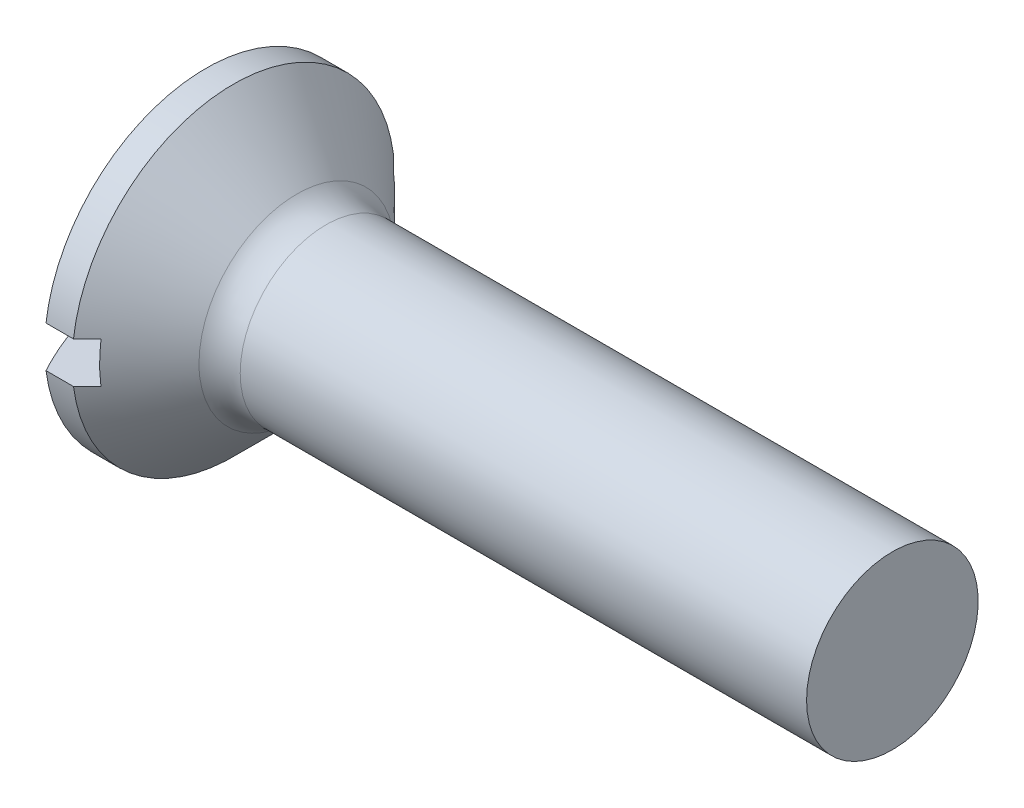
ISO-10303-21;
HEADER;
FILE_DESCRIPTION(('STEP AP214'),'2;1');
FILE_NAME('part.step','',(''),(''),'','','');
FILE_SCHEMA(('AUTOMOTIVE_DESIGN { 1 0 10303 214 1 1 1 1 }'));
ENDSEC;
DATA;
#1=APPLICATION_CONTEXT('core data for automotive mechanical design processes');
#2=APPLICATION_PROTOCOL_DEFINITION('international standard','automotive_design',2000,#1);
#3=PRODUCT_CONTEXT('',#1,'mechanical');
#4=PRODUCT('Part','Part','',(#3));
#5=PRODUCT_RELATED_PRODUCT_CATEGORY('part','',(#4));
#6=PRODUCT_DEFINITION_FORMATION('','',#4);
#7=PRODUCT_DEFINITION_CONTEXT('part definition',#1,'design');
#8=PRODUCT_DEFINITION('design','',#6,#7);
#9=PRODUCT_DEFINITION_SHAPE('','',#8);
#10=(LENGTH_UNIT() NAMED_UNIT(*) SI_UNIT(.MILLI.,.METRE.));
#11=(NAMED_UNIT(*) PLANE_ANGLE_UNIT() SI_UNIT($,.RADIAN.));
#12=(NAMED_UNIT(*) SI_UNIT($,.STERADIAN.) SOLID_ANGLE_UNIT());
#13=UNCERTAINTY_MEASURE_WITH_UNIT(LENGTH_MEASURE(1.E-05),#10,'distance_accuracy_value','');
#14=(GEOMETRIC_REPRESENTATION_CONTEXT(3) GLOBAL_UNCERTAINTY_ASSIGNED_CONTEXT((#13)) GLOBAL_UNIT_ASSIGNED_CONTEXT((#10,
#11,#12)) REPRESENTATION_CONTEXT('',''));
#15=CARTESIAN_POINT('',(0.,0.,0.));
#16=DIRECTION('',(0.,0.,1.));
#17=DIRECTION('',(1.,0.,0.));
#18=AXIS2_PLACEMENT_3D('',#15,#16,#17);
#19=CARTESIAN_POINT('',(4.90208333333334,0.,0.));
#20=DIRECTION('',(-1.,0.,0.));
#21=DIRECTION('',(0.,-1.,0.));
#22=AXIS2_PLACEMENT_3D('',#19,#20,#21);
#23=SPHERICAL_SURFACE('',#22,4.90208333333334);
#24=CARTESIAN_POINT('',(4.90208333333334,0.3,0.));
#25=DIRECTION('',(0.,1.,0.));
#26=DIRECTION('',(0.,0.,1.));
#27=AXIS2_PLACEMENT_3D('',#24,#25,#26);
#28=CIRCLE('',#27,4.89289495155419);
#29=CARTESIAN_POINT('',(0.6,0.3,2.33077240416133));
#30=VERTEX_POINT('',#29);
#31=CARTESIAN_POINT('',(0.6,0.3,-2.33077240416133));
#32=VERTEX_POINT('',#31);
#33=EDGE_CURVE('E185',#30,#32,#28,.F.);
#34=ORIENTED_EDGE('',*,*,#33,.F.);
#35=CARTESIAN_POINT('',(0.6,0.,0.));
#36=DIRECTION('',(-1.,0.,0.));
#37=DIRECTION('',(0.,0.,1.));
#38=AXIS2_PLACEMENT_3D('',#35,#36,#37);
#39=CIRCLE('',#38,2.35);
#40=EDGE_CURVE('E119',#30,#32,#39,.T.);
#41=ORIENTED_EDGE('',*,*,#40,.T.);
#42=EDGE_LOOP('',(#34,#41));
#43=FACE_BOUND('',#42,.T.);
#44=ADVANCED_FACE('F39',(#43),#23,.T.);
#45=CARTESIAN_POINT('',(-15.875,0.,0.));
#46=DIRECTION('',(-1.,0.,0.));
#47=DIRECTION('',(0.,0.,1.));
#48=AXIS2_PLACEMENT_3D('',#45,#46,#47);
#49=CYLINDRICAL_SURFACE('',#48,2.35);
#50=CARTESIAN_POINT('',(1.,0.,0.));
#51=DIRECTION('',(-1.,0.,0.));
#52=DIRECTION('',(0.,0.,1.));
#53=AXIS2_PLACEMENT_3D('',#50,#51,#52);
#54=CIRCLE('',#53,2.35);
#55=CARTESIAN_POINT('',(1.,0.3,2.33077240416133));
#56=VERTEX_POINT('',#55);
#57=CARTESIAN_POINT('',(1.,0.3,-2.33077240416133));
#58=VERTEX_POINT('',#57);
#59=EDGE_CURVE('E113',#56,#58,#54,.T.);
#60=ORIENTED_EDGE('',*,*,#59,.T.);
#61=DIRECTION('',(-1.,0.,0.));
#62=VECTOR('',#61,1.);
#63=CARTESIAN_POINT('',(-15.875,0.3,-2.33077240416133));
#64=LINE('',#63,#62);
#65=EDGE_CURVE('E67',#58,#32,#64,.T.);
#66=ORIENTED_EDGE('',*,*,#65,.T.);
#67=ORIENTED_EDGE('',*,*,#40,.F.);
#68=DIRECTION('',(-1.,0.,0.));
#69=VECTOR('',#68,1.);
#70=CARTESIAN_POINT('',(-15.875,0.3,2.33077240416133));
#71=LINE('',#70,#69);
#72=EDGE_CURVE('E183',#30,#56,#71,.F.);
#73=ORIENTED_EDGE('',*,*,#72,.T.);
#74=EDGE_LOOP('',(#60,#66,#67,#73));
#75=FACE_BOUND('',#74,.T.);
#76=ADVANCED_FACE('F157',(#75),#49,.T.);
#77=CARTESIAN_POINT('',(10.6,0.,0.));
#78=DIRECTION('',(-1.,0.,0.));
#79=DIRECTION('',(0.,0.,1.));
#80=AXIS2_PLACEMENT_3D('',#77,#78,#79);
#81=PLANE('',#80);
#82=CARTESIAN_POINT('',(10.6,0.,0.));
#83=DIRECTION('',(-1.,0.,0.));
#84=DIRECTION('',(0.,0.,1.));
#85=AXIS2_PLACEMENT_3D('',#82,#83,#84);
#86=CIRCLE('',#85,1.25);
#87=CARTESIAN_POINT('',(10.6,0.,1.25));
#88=VERTEX_POINT('',#87);
#89=EDGE_CURVE('E122',#88,#88,#86,.T.);
#90=ORIENTED_EDGE('',*,*,#89,.F.);
#91=EDGE_LOOP('',(#90));
#92=FACE_BOUND('',#91,.T.);
#93=ADVANCED_FACE('F164',(#92),#81,.F.);
#94=CARTESIAN_POINT('',(4.90208333333334,-0.3,0.));
#95=DIRECTION('',(0.,-1.,0.));
#96=DIRECTION('',(0.,0.,-1.));
#97=AXIS2_PLACEMENT_3D('',#94,#95,#96);
#98=CIRCLE('',#97,4.89289495155419);
#99=CARTESIAN_POINT('',(0.6,-0.299999999999999,-2.33077240416133));
#100=VERTEX_POINT('',#99);
#101=CARTESIAN_POINT('',(0.6,-0.3,2.33077240416133));
#102=VERTEX_POINT('',#101);
#103=EDGE_CURVE('E175',#100,#102,#98,.F.);
#104=ORIENTED_EDGE('',*,*,#103,.F.);
#105=EDGE_CURVE('E115',#100,#102,#39,.T.);
#106=ORIENTED_EDGE('',*,*,#105,.T.);
#107=EDGE_LOOP('',(#104,#106));
#108=FACE_BOUND('',#107,.T.);
#109=ADVANCED_FACE('F160',(#108),#23,.T.);
#110=CARTESIAN_POINT('',(1.,-0.299999999999999,-2.33077240416133));
#111=VERTEX_POINT('',#110);
#112=CARTESIAN_POINT('',(1.,-0.3,2.33077240416133));
#113=VERTEX_POINT('',#112);
#114=EDGE_CURVE('E116',#111,#113,#54,.T.);
#115=ORIENTED_EDGE('',*,*,#114,.T.);
#116=DIRECTION('',(-1.,0.,0.));
#117=VECTOR('',#116,1.);
#118=CARTESIAN_POINT('',(-15.875,-0.3,2.33077240416133));
#119=LINE('',#118,#117);
#120=EDGE_CURVE('E178',#113,#102,#119,.T.);
#121=ORIENTED_EDGE('',*,*,#120,.T.);
#122=ORIENTED_EDGE('',*,*,#105,.F.);
#123=DIRECTION('',(-1.,0.,0.));
#124=VECTOR('',#123,1.);
#125=CARTESIAN_POINT('',(-15.875,-0.299999999999999,-2.33077240416133));
#126=LINE('',#125,#124);
#127=EDGE_CURVE('E179',#100,#111,#126,.F.);
#128=ORIENTED_EDGE('',*,*,#127,.T.);
#129=EDGE_LOOP('',(#115,#121,#122,#128));
#130=FACE_BOUND('',#129,.T.);
#131=ADVANCED_FACE('F154',(#130),#49,.T.);
#132=CARTESIAN_POINT('',(1.,0.,0.));
#133=DIRECTION('',(-1.,0.,0.));
#134=DIRECTION('',(0.,0.,1.));
#135=AXIS2_PLACEMENT_3D('',#132,#133,#134);
#136=CONICAL_SURFACE('',#135,2.35,0.785398163397449);
#137=CARTESIAN_POINT('',(-1.82275203672138,0.3,-5.16404527801656));
#138=CARTESIAN_POINT('',(-1.64754958730794,0.3,-4.98854511223448));
#139=CARTESIAN_POINT('',(-1.47236000416515,0.3,-4.81303209254199));
#140=CARTESIAN_POINT('',(-1.12202075460717,0.3,-4.46196190687904));
#141=CARTESIAN_POINT('',(-0.94687108871008,0.3,-4.28640474039159));
#142=CARTESIAN_POINT('',(-0.596582016902504,0.3,-3.93518385937772));
#143=CARTESIAN_POINT('',(-0.421442627058235,0.3,-3.75952012882719));
#144=CARTESIAN_POINT('',(-0.0712537914550258,0.3,-3.40810721702208));
#145=CARTESIAN_POINT('',(0.103795655359153,0.3,-3.23235803681939));
#146=CARTESIAN_POINT('',(0.460088144205839,0.3,-2.87435321817226));
#147=CARTESIAN_POINT('',(0.64132596841188,0.3,-2.6920923874888));
#148=CARTESIAN_POINT('',(1.00354514464606,0.3,-2.32730280190244));
#149=CARTESIAN_POINT('',(1.18452648731344,0.3,-2.14477403769181));
#150=CARTESIAN_POINT('',(1.45556256140296,0.3,-1.87058192238541));
#151=CARTESIAN_POINT('',(1.54582728663923,0.3,-1.77912617438865));
#152=CARTESIAN_POINT('',(1.72613580420795,0.3,-1.59599412728003));
#153=CARTESIAN_POINT('',(1.8161795933095,0.3,-1.50431782498121));
#154=CARTESIAN_POINT('',(1.99588406923986,0.3,-1.32060275611908));
#155=CARTESIAN_POINT('',(2.08554478108396,0.3,-1.22856401400164));
#156=CARTESIAN_POINT('',(2.26418532619347,0.3,-1.04382868301959));
#157=CARTESIAN_POINT('',(2.35316518136162,0.3,-0.951132115503261));
#158=CARTESIAN_POINT('',(2.46505917883394,0.3,-0.832576740840201));
#159=CARTESIAN_POINT('',(2.48870474420126,0.3,-0.807409320196103));
#160=CARTESIAN_POINT('',(2.53583984019124,0.3,-0.756927871802545));
#161=CARTESIAN_POINT('',(2.55932936834119,0.3,-0.731613841741602));
#162=CARTESIAN_POINT('',(2.60601885231769,0.3,-0.680886100047077));
#163=CARTESIAN_POINT('',(2.62921954128008,0.3,-0.655473063997356));
#164=CARTESIAN_POINT('',(2.675337766447,0.3,-0.604392130207134));
#165=CARTESIAN_POINT('',(2.69825531271275,0.3,-0.578724241581383));
#166=CARTESIAN_POINT('',(2.7513958843352,0.3,-0.51826731406406));
#167=CARTESIAN_POINT('',(2.78145962199572,0.3,-0.483338135350433));
#168=CARTESIAN_POINT('',(2.8405689932522,0.3,-0.412218933886534));
#169=CARTESIAN_POINT('',(2.86960673903091,0.3,-0.376022191437645));
#170=CARTESIAN_POINT('',(2.9114850873813,0.3,-0.320072853564384));
#171=CARTESIAN_POINT('',(2.92524917786357,0.3,-0.301017234201491));
#172=CARTESIAN_POINT('',(2.95181957465597,0.3,-0.262201945071994));
#173=CARTESIAN_POINT('',(2.96462456529744,0.3,-0.242441361156985));
#174=CARTESIAN_POINT('',(2.98858863040398,0.3,-0.202182687483552));
#175=CARTESIAN_POINT('',(2.99976230181752,0.3,-0.181693479987382));
#176=CARTESIAN_POINT('',(3.01963945302138,0.3,-0.139575845156781));
#177=CARTESIAN_POINT('',(3.02835070556884,0.3,-0.117951263901652));
#178=CARTESIAN_POINT('',(3.04128209755064,0.3,-0.0753539742139996));
#179=CARTESIAN_POINT('',(3.04582445681639,0.3,-0.0544855635375963));
#180=CARTESIAN_POINT('',(3.05046691822308,0.3,-0.0123288497489134));
#181=CARTESIAN_POINT('',(3.05059046656826,0.3,0.00895663738570289));
#182=CARTESIAN_POINT('',(3.0464261956788,0.3,0.0509505716715626));
#183=CARTESIAN_POINT('',(3.04215902203701,0.3,0.0716612534321086));
#184=CARTESIAN_POINT('',(3.03030119680603,0.3,0.112203509888116));
#185=CARTESIAN_POINT('',(3.02268680351524,0.3,0.132027669143875));
#186=CARTESIAN_POINT('',(3.00622685916693,0.3,0.168572292117351));
#187=CARTESIAN_POINT('',(2.99760294736928,0.3,0.185396783307412));
#188=CARTESIAN_POINT('',(2.97917654074856,0.3,0.218395128215779));
#189=CARTESIAN_POINT('',(2.96937306670495,0.3,0.23456842627038));
#190=CARTESIAN_POINT('',(2.93871149333945,0.3,0.28243197683215));
#191=CARTESIAN_POINT('',(2.91666176421179,0.3,0.313348905503022));
#192=CARTESIAN_POINT('',(2.87076835420826,0.3,0.374243746859669));
#193=CARTESIAN_POINT('',(2.8469094719127,0.3,0.404209782728291));
#194=CARTESIAN_POINT('',(2.79830711124635,0.3,0.463297029753784));
#195=CARTESIAN_POINT('',(2.77356580894545,0.3,0.492420036344017));
#196=CARTESIAN_POINT('',(2.6995553977296,0.3,0.577829838417174));
#197=CARTESIAN_POINT('',(2.64948866646878,0.3,0.633419833726512));
#198=CARTESIAN_POINT('',(2.54836373861698,0.3,0.7436957712889));
#199=CARTESIAN_POINT('',(2.49730537025496,0.3,0.79838155382186));
#200=CARTESIAN_POINT('',(2.39456857586971,0.3,0.907291284144832));
#201=CARTESIAN_POINT('',(2.34288948055459,0.3,0.96151460047886));
#202=CARTESIAN_POINT('',(2.23919742314652,0.3,1.06963184533802));
#203=CARTESIAN_POINT('',(2.18718448744236,0.3,1.12352579925624));
#204=CARTESIAN_POINT('',(2.0318816012677,0.3,1.28379950959911));
#205=CARTESIAN_POINT('',(1.92827632250229,0.3,1.38987351167513));
#206=CARTESIAN_POINT('',(1.72070460330653,0.3,1.60156717940246));
#207=CARTESIAN_POINT('',(1.61673835836866,0.3,1.7071870373648));
#208=CARTESIAN_POINT('',(1.37557159980157,0.3,1.95163773521738));
#209=CARTESIAN_POINT('',(1.23828371519814,0.3,2.0903823802166));
#210=CARTESIAN_POINT('',(0.963486137442309,0.3,2.36765244003563));
#211=CARTESIAN_POINT('',(0.825976443595042,0.3,2.50617785416596));
#212=CARTESIAN_POINT('',(0.413192953066906,0.3,2.92161530315849));
#213=CARTESIAN_POINT('',(0.137721644880257,0.3,3.19833106315822));
#214=CARTESIAN_POINT('',(-0.418538177485844,0.3,3.75665266927046));
#215=CARTESIAN_POINT('',(-0.699330857482734,0.3,4.03825436110322));
#216=CARTESIAN_POINT('',(-1.26099255192529,0.3,4.60125960589025));
#217=CARTESIAN_POINT('',(-1.54186153654612,0.3,4.88266318859486));
#218=CARTESIAN_POINT('',(-1.82275203672138,0.3,5.16404527801656));
#219=B_SPLINE_CURVE_WITH_KNOTS('',3,(#137,#138,#139,#140,#141,#142,#143,#144,#145,#146,#147,
#148,#149,#150,#151,#152,#153,#154,#155,#156,#157,#158,#159,#160,#161,#162,#163,#164,#165,#166,
#167,#168,#169,#170,#171,#172,#173,#174,#175,#176,#177,#178,#179,#180,#181,#182,#183,#184,#185,
#186,#187,#188,#189,#190,#191,#192,#193,#194,#195,#196,#197,#198,#199,#200,#201,#202,#203,#204,
#205,#206,#207,#208,#209,#210,#211,#212,#213,#214,#215,#216,#217,#218),.UNSPECIFIED.,.F.,.F.,(4,
2,2,2,2,2,2,2,2,2,2,2,2,2,2,2,2,2,2,2,2,2,2,2,2,2,2,2,2,2,2,2,2,2,2,2,2,2,2,2,4),(0.,
0.743952870352577,1.48791490152672,2.23208151542587,2.97623918951494,3.74733929563187,
4.51846685478593,4.9039623477983,5.28946344501002,5.6749389716538,6.06040204521683,
6.16399983462291,6.26759926185074,6.37082991302826,6.47405688538717,6.61230458709904,
6.75145089376192,6.82195212826494,6.89254836759327,6.9624680798405,7.03216455728612,
7.09585752678058,7.15921249105328,7.22227090958055,7.28578400348509,7.34244077690176,
7.39914491306139,7.51294472887577,7.62783798502718,7.74246522116449,7.96687196692452,
8.19131793729752,8.41603267760232,8.64072986863151,9.08555454863182,9.53016739044921,
10.115728328683,10.7012911048979,11.8726592944065,13.0656791429272,14.2584398773778),.UNSPECIFIED.);
#220=CARTESIAN_POINT('',(1.2,0.3,2.12896688560438));
#221=VERTEX_POINT('',#220);
#222=EDGE_CURVE('E11',#221,#56,#219,.T.);
#223=ORIENTED_EDGE('',*,*,#222,.F.);
#224=CARTESIAN_POINT('',(1.2,0.,0.));
#225=DIRECTION('',(1.,0.,0.));
#226=DIRECTION('',(0.,0.,-1.));
#227=AXIS2_PLACEMENT_3D('',#224,#225,#226);
#228=CIRCLE('',#227,2.15);
#229=CARTESIAN_POINT('',(1.2,-0.3,2.12896688560438));
#230=VERTEX_POINT('',#229);
#231=EDGE_CURVE('E96',#230,#221,#228,.F.);
#232=ORIENTED_EDGE('',*,*,#231,.F.);
#233=CARTESIAN_POINT('',(-1.82275203672138,-0.3,5.16404527801656));
#234=CARTESIAN_POINT('',(-1.64754958730794,-0.3,4.98854511223448));
#235=CARTESIAN_POINT('',(-1.47236000416515,-0.3,4.81303209254199));
#236=CARTESIAN_POINT('',(-1.12202075460718,-0.3,4.46196190687904));
#237=CARTESIAN_POINT('',(-0.94687108871008,-0.3,4.28640474039159));
#238=CARTESIAN_POINT('',(-0.596582016902505,-0.3,3.93518385937772));
#239=CARTESIAN_POINT('',(-0.421442627058235,-0.3,3.75952012882719));
#240=CARTESIAN_POINT('',(-0.0712537914550263,-0.3,3.40810721702208));
#241=CARTESIAN_POINT('',(0.103795655359153,-0.3,3.23235803681939));
#242=CARTESIAN_POINT('',(0.460088144205839,-0.3,2.87435321817226));
#243=CARTESIAN_POINT('',(0.641325968411881,-0.3,2.6920923874888));
#244=CARTESIAN_POINT('',(1.00354514464606,-0.3,2.32730280190244));
#245=CARTESIAN_POINT('',(1.18452648731344,-0.3,2.14477403769181));
#246=CARTESIAN_POINT('',(1.45556256140296,-0.3,1.87058192238541));
#247=CARTESIAN_POINT('',(1.54582728663923,-0.3,1.77912617438865));
#248=CARTESIAN_POINT('',(1.72613580420796,-0.3,1.59599412728003));
#249=CARTESIAN_POINT('',(1.8161795933095,-0.3,1.50431782498121));
#250=CARTESIAN_POINT('',(1.99588406923986,-0.3,1.32060275611908));
#251=CARTESIAN_POINT('',(2.08554478108396,-0.3,1.22856401400164));
#252=CARTESIAN_POINT('',(2.26418532619348,-0.3,1.04382868301958));
#253=CARTESIAN_POINT('',(2.35316518136162,-0.3,0.95113211550326));
#254=CARTESIAN_POINT('',(2.46505917883394,-0.3,0.832576740840201));
#255=CARTESIAN_POINT('',(2.48870474420126,-0.3,0.807409320196102));
#256=CARTESIAN_POINT('',(2.53583984019124,-0.3,0.756927871802545));
#257=CARTESIAN_POINT('',(2.55932936834119,-0.3,0.731613841741602));
#258=CARTESIAN_POINT('',(2.60601885231769,-0.3,0.680886100047076));
#259=CARTESIAN_POINT('',(2.62921954128008,-0.3,0.655473063997356));
#260=CARTESIAN_POINT('',(2.675337766447,-0.3,0.604392130207134));
#261=CARTESIAN_POINT('',(2.69825531271275,-0.3,0.578724241581382));
#262=CARTESIAN_POINT('',(2.7513958843352,-0.3,0.518267314064059));
#263=CARTESIAN_POINT('',(2.78145962199572,-0.3,0.483338135350433));
#264=CARTESIAN_POINT('',(2.8405689932522,-0.3,0.412218933886534));
#265=CARTESIAN_POINT('',(2.86960673903091,-0.3,0.376022191437645));
#266=CARTESIAN_POINT('',(2.9114850873813,-0.3,0.320072853564383));
#267=CARTESIAN_POINT('',(2.92524917786357,-0.3,0.301017234201491));
#268=CARTESIAN_POINT('',(2.95181957465597,-0.3,0.262201945071994));
#269=CARTESIAN_POINT('',(2.96462456529745,-0.3,0.242441361156985));
#270=CARTESIAN_POINT('',(2.98858863040398,-0.3,0.202182687483552));
#271=CARTESIAN_POINT('',(2.99976230181752,-0.3,0.181693479987382));
#272=CARTESIAN_POINT('',(3.01963945302138,-0.3,0.13957584515678));
#273=CARTESIAN_POINT('',(3.02835070556884,-0.3,0.117951263901652));
#274=CARTESIAN_POINT('',(3.04128209755064,-0.3,0.0753539742139996));
#275=CARTESIAN_POINT('',(3.04582445681639,-0.3,0.0544855635375964));
#276=CARTESIAN_POINT('',(3.05046691822308,-0.3,0.0123288497489135));
#277=CARTESIAN_POINT('',(3.05059046656826,-0.3,-0.00895663738570284));
#278=CARTESIAN_POINT('',(3.0464261956788,-0.3,-0.0509505716715626));
#279=CARTESIAN_POINT('',(3.04215902203701,-0.3,-0.0716612534321086));
#280=CARTESIAN_POINT('',(3.03030119680603,-0.3,-0.112203509888116));
#281=CARTESIAN_POINT('',(3.02268680351524,-0.3,-0.132027669143875));
#282=CARTESIAN_POINT('',(3.00622685916693,-0.3,-0.168572292117351));
#283=CARTESIAN_POINT('',(2.99760294736928,-0.3,-0.185396783307412));
#284=CARTESIAN_POINT('',(2.97917654074856,-0.3,-0.218395128215779));
#285=CARTESIAN_POINT('',(2.96937306670495,-0.3,-0.234568426270379));
#286=CARTESIAN_POINT('',(2.93871149333945,-0.3,-0.282431976832149));
#287=CARTESIAN_POINT('',(2.91666176421179,-0.3,-0.313348905503022));
#288=CARTESIAN_POINT('',(2.87076835420826,-0.3,-0.374243746859668));
#289=CARTESIAN_POINT('',(2.8469094719127,-0.3,-0.404209782728291));
#290=CARTESIAN_POINT('',(2.79830711124635,-0.3,-0.463297029753784));
#291=CARTESIAN_POINT('',(2.77356580894545,-0.3,-0.492420036344017));
#292=CARTESIAN_POINT('',(2.6995553977296,-0.3,-0.577829838417173));
#293=CARTESIAN_POINT('',(2.64948866646879,-0.3,-0.633419833726511));
#294=CARTESIAN_POINT('',(2.54836373861698,-0.3,-0.743695771288899));
#295=CARTESIAN_POINT('',(2.49730537025496,-0.3,-0.798381553821859));
#296=CARTESIAN_POINT('',(2.39456857586971,-0.3,-0.907291284144831));
#297=CARTESIAN_POINT('',(2.34288948055459,-0.3,-0.961514600478859));
#298=CARTESIAN_POINT('',(2.23919742314653,-0.3,-1.06963184533802));
#299=CARTESIAN_POINT('',(2.18718448744236,-0.299999999999999,-1.12352579925624));
#300=CARTESIAN_POINT('',(2.0318816012677,-0.299999999999999,-1.28379950959911));
#301=CARTESIAN_POINT('',(1.9282763225023,-0.299999999999999,-1.38987351167513));
#302=CARTESIAN_POINT('',(1.72070460330653,-0.299999999999999,-1.60156717940246));
#303=CARTESIAN_POINT('',(1.61673835836866,-0.299999999999999,-1.7071870373648));
#304=CARTESIAN_POINT('',(1.37557159980157,-0.299999999999999,-1.95163773521738));
#305=CARTESIAN_POINT('',(1.23828371519814,-0.299999999999999,-2.0903823802166));
#306=CARTESIAN_POINT('',(0.963486137442309,-0.299999999999999,-2.36765244003563));
#307=CARTESIAN_POINT('',(0.825976443595042,-0.299999999999999,-2.50617785416596));
#308=CARTESIAN_POINT('',(0.413192953066907,-0.299999999999999,-2.92161530315849));
#309=CARTESIAN_POINT('',(0.137721644880258,-0.299999999999999,-3.19833106315821));
#310=CARTESIAN_POINT('',(-0.418538177485843,-0.299999999999999,-3.75665266927046));
#311=CARTESIAN_POINT('',(-0.699330857482733,-0.299999999999999,-4.03825436110322));
#312=CARTESIAN_POINT('',(-1.26099255192529,-0.299999999999999,-4.60125960589025));
#313=CARTESIAN_POINT('',(-1.54186153654612,-0.299999999999999,-4.88266318859487));
#314=CARTESIAN_POINT('',(-1.82275203672138,-0.299999999999999,-5.16404527801657));
#315=B_SPLINE_CURVE_WITH_KNOTS('',3,(#233,#234,#235,#236,#237,#238,#239,#240,#241,#242,#243,
#244,#245,#246,#247,#248,#249,#250,#251,#252,#253,#254,#255,#256,#257,#258,#259,#260,#261,#262,
#263,#264,#265,#266,#267,#268,#269,#270,#271,#272,#273,#274,#275,#276,#277,#278,#279,#280,#281,
#282,#283,#284,#285,#286,#287,#288,#289,#290,#291,#292,#293,#294,#295,#296,#297,#298,#299,#300,
#301,#302,#303,#304,#305,#306,#307,#308,#309,#310,#311,#312,#313,#314),.UNSPECIFIED.,.F.,.F.,(4,
2,2,2,2,2,2,2,2,2,2,2,2,2,2,2,2,2,2,2,2,2,2,2,2,2,2,2,2,2,2,2,2,2,2,2,2,2,2,2,4),(0.,
0.743952870352577,1.48791490152672,2.23208151542587,2.97623918951494,3.74733929563187,
4.51846685478593,4.9039623477983,5.28946344501002,5.6749389716538,6.06040204521683,
6.16399983462291,6.26759926185074,6.37082991302826,6.47405688538717,6.61230458709904,
6.75145089376193,6.82195212826494,6.89254836759327,6.96246807984051,7.03216455728612,
7.09585752678058,7.15921249105328,7.22227090958055,7.28578400348509,7.34244077690176,
7.39914491306139,7.51294472887577,7.62783798502718,7.74246522116449,7.96687196692452,
8.19131793729751,8.41603267760232,8.64072986863151,9.08555454863182,9.53016739044921,
10.115728328683,10.7012911048979,11.8726592944065,13.0656791429272,14.2584398773778),.UNSPECIFIED.);
#316=EDGE_CURVE('E53',#113,#230,#315,.T.);
#317=ORIENTED_EDGE('',*,*,#316,.F.);
#318=ORIENTED_EDGE('',*,*,#114,.F.);
#319=CARTESIAN_POINT('',(1.2,-0.299999999999999,-2.12896688560438));
#320=VERTEX_POINT('',#319);
#321=EDGE_CURVE('E131',#320,#111,#315,.T.);
#322=ORIENTED_EDGE('',*,*,#321,.F.);
#323=CARTESIAN_POINT('',(1.2,0.3,-2.12896688560438));
#324=VERTEX_POINT('',#323);
#325=EDGE_CURVE('E104',#324,#320,#228,.F.);
#326=ORIENTED_EDGE('',*,*,#325,.F.);
#327=EDGE_CURVE('E43',#58,#324,#219,.T.);
#328=ORIENTED_EDGE('',*,*,#327,.F.);
#329=ORIENTED_EDGE('',*,*,#59,.F.);
#330=EDGE_LOOP('',(#223,#232,#317,#318,#322,#326,#328,#329));
#331=FACE_BOUND('',#330,.T.);
#332=CARTESIAN_POINT('',(1.92426406871193,0.,0.));
#333=DIRECTION('',(1.,0.,0.));
#334=DIRECTION('',(0.,0.,-1.));
#335=AXIS2_PLACEMENT_3D('',#332,#333,#334);
#336=CIRCLE('',#335,1.42573593128807);
#337=CARTESIAN_POINT('',(1.92426406871193,0.,-1.42573593128807));
#338=VERTEX_POINT('',#337);
#339=EDGE_CURVE('E126',#338,#338,#336,.F.);
#340=ORIENTED_EDGE('',*,*,#339,.T.);
#341=EDGE_LOOP('',(#340));
#342=FACE_BOUND('',#341,.T.);
#343=ADVANCED_FACE('F110',(#331,#342),#136,.T.);
#344=CARTESIAN_POINT('',(-15.875,0.,0.));
#345=DIRECTION('',(-1.,0.,0.));
#346=DIRECTION('',(0.,0.,1.));
#347=AXIS2_PLACEMENT_3D('',#344,#345,#346);
#348=CYLINDRICAL_SURFACE('',#347,1.25);
#349=CARTESIAN_POINT('',(2.34852813742386,0.,0.));
#350=DIRECTION('',(-1.,0.,0.));
#351=DIRECTION('',(0.,0.,1.));
#352=AXIS2_PLACEMENT_3D('',#349,#350,#351);
#353=CIRCLE('',#352,1.25);
#354=CARTESIAN_POINT('',(2.34852813742386,0.,1.25));
#355=VERTEX_POINT('',#354);
#356=EDGE_CURVE('E129',#355,#355,#353,.F.);
#357=ORIENTED_EDGE('',*,*,#356,.T.);
#358=EDGE_LOOP('',(#357));
#359=FACE_BOUND('',#358,.T.);
#360=ORIENTED_EDGE('',*,*,#89,.T.);
#361=EDGE_LOOP('',(#360));
#362=FACE_BOUND('',#361,.T.);
#363=ADVANCED_FACE('F146',(#359,#362),#348,.T.);
#364=CARTESIAN_POINT('',(2.34852813742386,0.,0.));
#365=DIRECTION('',(-1.,0.,0.));
#366=DIRECTION('',(0.,0.,1.));
#367=AXIS2_PLACEMENT_3D('',#364,#365,#366);
#368=TOROIDAL_SURFACE('',#367,1.85,0.6);
#369=ORIENTED_EDGE('',*,*,#356,.F.);
#370=EDGE_LOOP('',(#369));
#371=FACE_BOUND('',#370,.T.);
#372=ORIENTED_EDGE('',*,*,#339,.F.);
#373=EDGE_LOOP('',(#372));
#374=FACE_BOUND('',#373,.T.);
#375=ADVANCED_FACE('F41',(#371,#374),#368,.F.);
#376=CARTESIAN_POINT('',(1.2,0.3,2.35));
#377=DIRECTION('',(0.,1.,0.));
#378=DIRECTION('',(0.,0.,1.));
#379=AXIS2_PLACEMENT_3D('',#376,#377,#378);
#380=PLANE('',#379);
#381=ORIENTED_EDGE('',*,*,#327,.T.);
#382=DIRECTION('',(0.,0.,-1.));
#383=VECTOR('',#382,1.);
#384=CARTESIAN_POINT('',(1.2,0.3,2.35));
#385=LINE('',#384,#383);
#386=EDGE_CURVE('E60',#221,#324,#385,.T.);
#387=ORIENTED_EDGE('',*,*,#386,.F.);
#388=ORIENTED_EDGE('',*,*,#222,.T.);
#389=ORIENTED_EDGE('',*,*,#72,.F.);
#390=ORIENTED_EDGE('',*,*,#33,.T.);
#391=ORIENTED_EDGE('',*,*,#65,.F.);
#392=EDGE_LOOP('',(#381,#387,#388,#389,#390,#391));
#393=FACE_BOUND('',#392,.T.);
#394=ADVANCED_FACE('F105',(#393),#380,.F.);
#395=CARTESIAN_POINT('',(1.2,-0.299999999999999,-2.35));
#396=DIRECTION('',(0.,-1.,0.));
#397=DIRECTION('',(0.,0.,-1.));
#398=AXIS2_PLACEMENT_3D('',#395,#396,#397);
#399=PLANE('',#398);
#400=ORIENTED_EDGE('',*,*,#316,.T.);
#401=DIRECTION('',(0.,0.,1.));
#402=VECTOR('',#401,1.);
#403=CARTESIAN_POINT('',(1.2,-0.299999999999999,-2.35));
#404=LINE('',#403,#402);
#405=EDGE_CURVE('E99',#320,#230,#404,.T.);
#406=ORIENTED_EDGE('',*,*,#405,.F.);
#407=ORIENTED_EDGE('',*,*,#321,.T.);
#408=ORIENTED_EDGE('',*,*,#127,.F.);
#409=ORIENTED_EDGE('',*,*,#103,.T.);
#410=ORIENTED_EDGE('',*,*,#120,.F.);
#411=EDGE_LOOP('',(#400,#406,#407,#408,#409,#410));
#412=FACE_BOUND('',#411,.T.);
#413=ADVANCED_FACE('F139',(#412),#399,.F.);
#414=CARTESIAN_POINT('',(1.2,-0.299999999999999,-2.35));
#415=DIRECTION('',(1.,0.,0.));
#416=DIRECTION('',(0.,0.,-1.));
#417=AXIS2_PLACEMENT_3D('',#414,#415,#416);
#418=PLANE('',#417);
#419=ORIENTED_EDGE('',*,*,#231,.T.);
#420=ORIENTED_EDGE('',*,*,#386,.T.);
#421=ORIENTED_EDGE('',*,*,#325,.T.);
#422=ORIENTED_EDGE('',*,*,#405,.T.);
#423=EDGE_LOOP('',(#419,#420,#421,#422));
#424=FACE_BOUND('',#423,.T.);
#425=ADVANCED_FACE('F97',(#424),#418,.F.);
#426=CLOSED_SHELL('',(#44,#76,#93,#109,#131,#343,#363,#375,#394,#413,#425));
#427=MANIFOLD_SOLID_BREP('B2',#426);
#428=ADVANCED_BREP_SHAPE_REPRESENTATION('',(#18,#427),#14);
#429=SHAPE_DEFINITION_REPRESENTATION(#9,#428);
ENDSEC;
END-ISO-10303-21;
